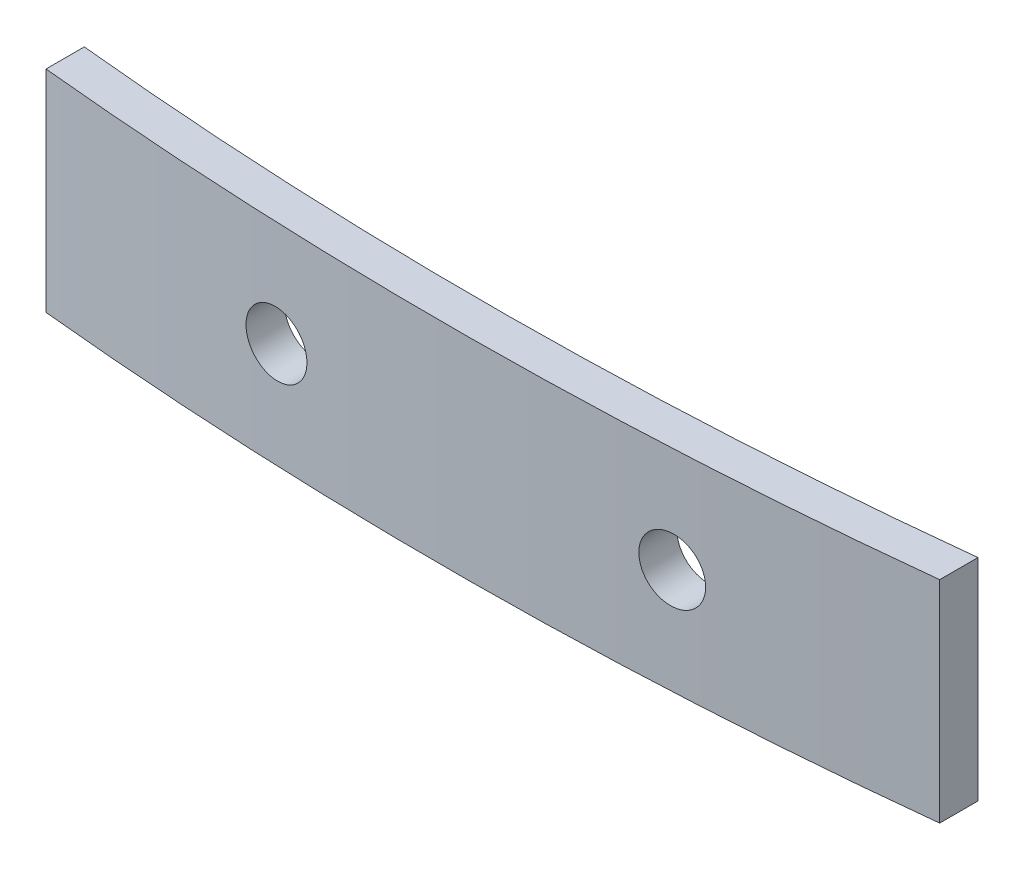
ISO-10303-21;
HEADER;
FILE_DESCRIPTION(('STEP AP214'),'2;1');
FILE_NAME('part.step','',(''),(''),'','','');
FILE_SCHEMA(('AUTOMOTIVE_DESIGN { 1 0 10303 214 1 1 1 1 }'));
ENDSEC;
DATA;
#1=APPLICATION_CONTEXT('core data for automotive mechanical design processes');
#2=APPLICATION_PROTOCOL_DEFINITION('international standard','automotive_design',2000,#1);
#3=PRODUCT_CONTEXT('',#1,'mechanical');
#4=PRODUCT('Part','Part','',(#3));
#5=PRODUCT_RELATED_PRODUCT_CATEGORY('part','',(#4));
#6=PRODUCT_DEFINITION_FORMATION('','',#4);
#7=PRODUCT_DEFINITION_CONTEXT('part definition',#1,'design');
#8=PRODUCT_DEFINITION('design','',#6,#7);
#9=PRODUCT_DEFINITION_SHAPE('','',#8);
#10=(LENGTH_UNIT() NAMED_UNIT(*) SI_UNIT(.MILLI.,.METRE.));
#11=(NAMED_UNIT(*) PLANE_ANGLE_UNIT() SI_UNIT($,.RADIAN.));
#12=(NAMED_UNIT(*) SI_UNIT($,.STERADIAN.) SOLID_ANGLE_UNIT());
#13=UNCERTAINTY_MEASURE_WITH_UNIT(LENGTH_MEASURE(1.E-05),#10,'distance_accuracy_value','');
#14=(GEOMETRIC_REPRESENTATION_CONTEXT(3) GLOBAL_UNCERTAINTY_ASSIGNED_CONTEXT((#13)) GLOBAL_UNIT_ASSIGNED_CONTEXT((#10,
#11,#12)) REPRESENTATION_CONTEXT('',''));
#15=CARTESIAN_POINT('',(0.,0.,0.));
#16=DIRECTION('',(0.,0.,1.));
#17=DIRECTION('',(1.,0.,0.));
#18=AXIS2_PLACEMENT_3D('',#15,#16,#17);
#19=CARTESIAN_POINT('',(-0.864955357188,8.3,-164.510629845193));
#20=DIRECTION('',(0.,-1.,0.));
#21=DIRECTION('',(0.,0.,-1.));
#22=AXIS2_PLACEMENT_3D('',#19,#20,#21);
#23=CYLINDRICAL_SURFACE('',#22,167.210703971618);
#24=CARTESIAN_POINT('',(-0.864955357188,0.,-164.510629845193));
#25=DIRECTION('',(0.,-1.,0.));
#26=DIRECTION('',(0.,0.,1.));
#27=AXIS2_PLACEMENT_3D('',#24,#25,#26);
#28=CIRCLE('',#27,167.210703971618);
#29=CARTESIAN_POINT('',(17.5,0.,1.68849150450751));
#30=VERTEX_POINT('',#29);
#31=CARTESIAN_POINT('',(-17.5,0.,1.87054340591625));
#32=VERTEX_POINT('',#31);
#33=EDGE_CURVE('E117',#30,#32,#28,.T.);
#34=ORIENTED_EDGE('',*,*,#33,.T.);
#35=DIRECTION('',(0.,-1.,0.));
#36=VECTOR('',#35,1.);
#37=CARTESIAN_POINT('',(-17.5,8.3,1.87054340591625));
#38=LINE('',#37,#36);
#39=CARTESIAN_POINT('',(-17.5,8.3,1.87054340591625));
#40=VERTEX_POINT('',#39);
#41=EDGE_CURVE('E11',#40,#32,#38,.T.);
#42=ORIENTED_EDGE('',*,*,#41,.F.);
#43=CARTESIAN_POINT('',(-0.864955357188,8.3,-164.510629845193));
#44=DIRECTION('',(0.,-1.,0.));
#45=DIRECTION('',(0.,0.,1.));
#46=AXIS2_PLACEMENT_3D('',#43,#44,#45);
#47=CIRCLE('',#46,167.210703971618);
#48=CARTESIAN_POINT('',(17.5,8.3,1.68849150450751));
#49=VERTEX_POINT('',#48);
#50=EDGE_CURVE('E99',#49,#40,#47,.T.);
#51=ORIENTED_EDGE('',*,*,#50,.F.);
#52=DIRECTION('',(0.,-1.,0.));
#53=VECTOR('',#52,1.);
#54=CARTESIAN_POINT('',(17.5,8.3,1.68849150450751));
#55=LINE('',#54,#53);
#56=EDGE_CURVE('E113',#49,#30,#55,.T.);
#57=ORIENTED_EDGE('',*,*,#56,.T.);
#58=EDGE_LOOP('',(#34,#42,#51,#57));
#59=FACE_BOUND('',#58,.T.);
#60=CARTESIAN_POINT('',(6.5,4.15,2.53779713115004));
#61=CARTESIAN_POINT('',(6.50000311830072,4.2201600528483,2.53779703356888));
#62=CARTESIAN_POINT('',(6.50592683250922,4.29037097447346,2.53753615101918));
#63=CARTESIAN_POINT('',(6.52947445822004,4.42885834488722,2.53649543364698));
#64=CARTESIAN_POINT('',(6.54711244591845,4.49713236319745,2.5357149744841));
#65=CARTESIAN_POINT('',(6.593583155423,4.6297187466707,2.53364651229168));
#66=CARTESIAN_POINT('',(6.62241033254543,4.69403305576497,2.53235876064082));
#67=CARTESIAN_POINT('',(6.69042977820944,4.81688874962342,2.52929601535595));
#68=CARTESIAN_POINT('',(6.72961948369922,4.87543155699319,2.52752114220171));
#69=CARTESIAN_POINT('',(6.81727240701778,4.98513523567161,2.52351282987057));
#70=CARTESIAN_POINT('',(6.86574015724651,5.03629247755706,2.52127916653188));
#71=CARTESIAN_POINT('',(6.97055942325953,5.12974635220956,2.51639484759461));
#72=CARTESIAN_POINT('',(7.02691128046353,5.17204260105485,2.51374417393686));
#73=CARTESIAN_POINT('',(7.14595131480201,5.24661412268197,2.50807702763504));
#74=CARTESIAN_POINT('',(7.2086452692116,5.27888014756526,2.50506022095671));
#75=CARTESIAN_POINT('',(7.33854573429652,5.33243009041771,2.49873012293615));
#76=CARTESIAN_POINT('',(7.40575226418267,5.35371396163058,2.4954168303317));
#77=CARTESIAN_POINT('',(7.5428494216453,5.38471994256582,2.4885709153848));
#78=CARTESIAN_POINT('',(7.61274294738313,5.39442918509865,2.48503805353334));
#79=CARTESIAN_POINT('',(7.7531616222027,5.40197190758309,2.47785036870086));
#80=CARTESIAN_POINT('',(7.82368677376782,5.39980534082174,2.47419554524016));
#81=CARTESIAN_POINT('',(7.96342985722233,5.38365274089719,2.46686575840938));
#82=CARTESIAN_POINT('',(8.0326466378837,5.36965675272819,2.46319078066725));
#83=CARTESIAN_POINT('',(8.16774794433558,5.33022812559369,2.45593678797151));
#84=CARTESIAN_POINT('',(8.23363245930642,5.30479544949665,2.45235777332949));
#85=CARTESIAN_POINT('',(8.36020377089505,5.24320862112569,2.44541222559091));
#86=CARTESIAN_POINT('',(8.42089009855844,5.20705350283695,2.4420457116723));
#87=CARTESIAN_POINT('',(8.53533088617573,5.12504404492505,2.43564124626815));
#88=CARTESIAN_POINT('',(8.58908537368798,5.07918974386402,2.4326032934764));
#89=CARTESIAN_POINT('',(8.68808413564137,4.97912437454379,2.42696754118702));
#90=CARTESIAN_POINT('',(8.73333590873341,4.92492074717713,2.42436935405706));
#91=CARTESIAN_POINT('',(8.81409389396076,4.80966323539121,2.41970643279685));
#92=CARTESIAN_POINT('',(8.8496001867816,4.74860940769255,2.41764169425003));
#93=CARTESIAN_POINT('',(8.90980168821073,4.62148553155661,2.41412733536457));
#94=CARTESIAN_POINT('',(8.93451353604402,4.55542338906069,2.41267676841059));
#95=CARTESIAN_POINT('',(8.97249675193018,4.4200775166296,2.41044259271686));
#96=CARTESIAN_POINT('',(8.98576822175059,4.3507938153575,2.40965897804425));
#97=CARTESIAN_POINT('',(9.00047882200267,4.21107570744998,2.4087901949542));
#98=CARTESIAN_POINT('',(9.00193452056621,4.14064305088972,2.40870404854379));
#99=CARTESIAN_POINT('',(8.9930154142881,4.00053370594098,2.40923102871897));
#100=CARTESIAN_POINT('',(8.98264065708287,3.93085701450969,2.40984415248887));
#101=CARTESIAN_POINT('',(8.9503655620009,3.79426844369779,2.41174509717095));
#102=CARTESIAN_POINT('',(8.92847026623645,3.72735536859114,2.4130326229213));
#103=CARTESIAN_POINT('',(8.8737837915955,3.59815694385367,2.4162320685688));
#104=CARTESIAN_POINT('',(8.84099258100937,3.53587160769127,2.41814399028308));
#105=CARTESIAN_POINT('',(8.76541982221783,3.41764155961199,2.42252092143321));
#106=CARTESIAN_POINT('',(8.72263037518888,3.36170191310341,2.42498636810516));
#107=CARTESIAN_POINT('',(8.62829367522125,3.2577981137888,2.43037761471364));
#108=CARTESIAN_POINT('',(8.57674634798289,3.20983402865227,2.43330341855572));
#109=CARTESIAN_POINT('',(8.46627103909551,3.12316384761996,2.43951479784418));
#110=CARTESIAN_POINT('',(8.40733179566604,3.08447214599152,2.4428009212656));
#111=CARTESIAN_POINT('',(8.28380750137,3.01753168134166,2.44961536945369));
#112=CARTESIAN_POINT('',(8.21922240939069,2.98928299437351,2.45314369598402));
#113=CARTESIAN_POINT('',(8.08614019581266,2.94399119053169,2.46033126551108));
#114=CARTESIAN_POINT('',(8.0176376688324,2.92696398359887,2.46399068666331));
#115=CARTESIAN_POINT('',(7.87874601955412,2.90466003783105,2.47132140491645));
#116=CARTESIAN_POINT('',(7.80835688551057,2.89938337216909,2.47499270209117));
#117=CARTESIAN_POINT('',(7.66764528599877,2.90073180929488,2.48224190393867));
#118=CARTESIAN_POINT('',(7.59732288570206,2.90736404166644,2.48581975136414));
#119=CARTESIAN_POINT('',(7.45878462599334,2.93235966108019,2.49278235889512));
#120=CARTESIAN_POINT('',(7.39056876893537,2.95072306123143,2.49616711878486));
#121=CARTESIAN_POINT('',(7.25820669782941,2.99865642610158,2.5026575116878));
#122=CARTESIAN_POINT('',(7.19405912200034,3.02822261753584,2.50576323824877));
#123=CARTESIAN_POINT('',(7.07163847251114,3.09772642357956,2.51162544242854));
#124=CARTESIAN_POINT('',(7.01336514139768,3.13766358338107,2.51438193535473));
#125=CARTESIAN_POINT('',(6.9044123768105,3.2267300456736,2.5194854771111));
#126=CARTESIAN_POINT('',(6.85372481706355,3.27584938297113,2.52183296453855));
#127=CARTESIAN_POINT('',(6.76130334568271,3.38193224768082,2.5260782387648));
#128=CARTESIAN_POINT('',(6.71957161192582,3.43889767758814,2.52797591619053));
#129=CARTESIAN_POINT('',(6.64629504219877,3.55899830925378,2.53128701689445));
#130=CARTESIAN_POINT('',(6.614743919168,3.62212967172133,2.53270073907335));
#131=CARTESIAN_POINT('',(6.56272376021015,3.75275215207936,2.53502196922212));
#132=CARTESIAN_POINT('',(6.54224136968559,3.82023790573416,2.5359300872515));
#133=CARTESIAN_POINT('',(6.51840966169869,3.93179630078508,2.53698468836411));
#134=CARTESIAN_POINT('',(6.51151470431355,3.97514204431732,2.53728912928755));
#135=CARTESIAN_POINT('',(6.50230890007655,4.06231856832874,2.53769538112666));
#136=CARTESIAN_POINT('',(6.49999805103457,4.10614934857616,2.53779719213913));
#137=CARTESIAN_POINT('',(6.5,4.15,2.53779713115004));
#138=B_SPLINE_CURVE_WITH_KNOTS('',3,(#60,#61,#62,#63,#64,#65,#66,#67,#68,#69,#70,#71,#72,#73,
#74,#75,#76,#77,#78,#79,#80,#81,#82,#83,#84,#85,#86,#87,#88,#89,#90,#91,#92,#93,#94,#95,#96,#97,
#98,#99,#100,#101,#102,#103,#104,#105,#106,#107,#108,#109,#110,#111,#112,#113,#114,#115,#116,
#117,#118,#119,#120,#121,#122,#123,#124,#125,#126,#127,#128,#129,#130,#131,#132,#133,#134,#135,
#136,#137),.UNSPECIFIED.,.T.,.F.,(4,2,2,2,2,2,2,2,2,2,2,2,2,2,2,2,2,2,2,2,2,2,2,2,2,2,2,2,2,2,2,
2,2,2,2,2,2,2,4),(0.,0.210320035472163,0.420893255693905,0.631362261542145,0.841779258925773,
1.05229931024653,1.2628284809202,1.47355118835342,1.68427479292679,1.89523243521323,
2.10619090729285,2.31732708766128,2.52846395353147,2.7396198470939,2.95077490115542,
3.1617428517856,3.37270905570111,3.58334890570873,3.79398688195663,4.00432944949815,
4.21467117007918,4.424920908374,4.63517125854935,4.84558827603943,5.05600707874424,
5.26675044568951,5.47749534738359,5.68853840640857,5.89958277963837,6.11075354241696,
6.32192454116966,6.53302447718547,6.74411515719746,6.95497806183269,7.16589218613083,
7.3766758095064,7.58720454814038,7.71865648688288,7.8501083628226),.UNSPECIFIED.);
#139=CARTESIAN_POINT('',(6.5,4.15,2.53779713115004));
#140=VERTEX_POINT('',#139);
#141=EDGE_CURVE('E138',#140,#140,#138,.T.);
#142=ORIENTED_EDGE('',*,*,#141,.F.);
#143=EDGE_LOOP('',(#142));
#144=FACE_BOUND('',#143,.T.);
#145=CARTESIAN_POINT('',(-9.,4.15,2.50206599360675));
#146=CARTESIAN_POINT('',(-8.9999968789846,4.22015392659101,2.50206618554172));
#147=CARTESIAN_POINT('',(-8.99407417658717,4.29035873068543,2.50235496193518));
#148=CARTESIAN_POINT('',(-8.97053082535261,4.42883359318577,2.50349920546083));
#149=CARTESIAN_POINT('',(-8.95289609973919,4.4971012202016,2.50435535452016));
#150=CARTESIAN_POINT('',(-8.90643478571085,4.62967430947023,2.50659881430219));
#151=CARTESIAN_POINT('',(-8.87761385256324,4.69398175481704,2.5079858566231));
#152=CARTESIAN_POINT('',(-8.80960947329652,4.81682546464163,2.51123443252684));
#153=CARTESIAN_POINT('',(-8.77042857227543,4.87536314171671,2.51309584956758));
#154=CARTESIAN_POINT('',(-8.68278601070888,4.9850703860922,2.51722102597792));
#155=CARTESIAN_POINT('',(-8.63431808054086,5.036234934716,2.51948505707536));
#156=CARTESIAN_POINT('',(-8.52949361157527,5.12970468199198,2.5243279425006));
#157=CARTESIAN_POINT('',(-8.47313672058647,5.17200948490304,2.52690681088319));
#158=CARTESIAN_POINT('',(-8.35407035350533,5.24660359631099,2.53228748153317));
#159=CARTESIAN_POINT('',(-8.29135420853412,5.27888224334472,2.53508951715917));
#160=CARTESIAN_POINT('',(-8.16139801259883,5.33245139876033,2.54081634269377));
#161=CARTESIAN_POINT('',(-8.09415794839092,5.35374187497259,2.54374113296173));
#162=CARTESIAN_POINT('',(-7.95700562805629,5.38474509749862,2.54961993904171));
#163=CARTESIAN_POINT('',(-7.88709133618139,5.39444883483721,2.55257397579667));
#164=CARTESIAN_POINT('',(-7.74662363106475,5.40197266553775,2.55841906921826));
#165=CARTESIAN_POINT('',(-7.67607021805432,5.39979276320068,2.56131012590768));
#166=CARTESIAN_POINT('',(-7.53631737546828,5.38360795028121,2.56694897423169));
#167=CARTESIAN_POINT('',(-7.46711812818554,5.36960145869888,2.56969674665963));
#168=CARTESIAN_POINT('',(-7.33204995513501,5.33015574247033,2.57497929333489));
#169=CARTESIAN_POINT('',(-7.26618102694138,5.30471652615198,2.57751406773735));
#170=CARTESIAN_POINT('',(-7.13967529197927,5.24313791888805,2.58231262134722));
#171=CARTESIAN_POINT('',(-7.07903622405426,5.20700318245829,2.58457651783571));
#172=CARTESIAN_POINT('',(-6.96468446660637,5.12505256805409,2.58878998227595));
#173=CARTESIAN_POINT('',(-6.9109717504013,5.0792367273757,2.59073955143857));
#174=CARTESIAN_POINT('',(-6.81203747553293,4.97925802415904,2.59428986539865));
#175=CARTESIAN_POINT('',(-6.76681012773489,4.9251008987258,2.59589084813945));
#176=CARTESIAN_POINT('',(-6.68608977992854,4.80995352949493,2.59872223701323));
#177=CARTESIAN_POINT('',(-6.65059674771484,4.7489633083051,2.59995264437223));
#178=CARTESIAN_POINT('',(-6.590376060798,4.62192237655231,2.6020267438483));
#179=CARTESIAN_POINT('',(-6.56564166867781,4.55587486360173,2.60287067800525));
#180=CARTESIAN_POINT('',(-6.52761073193537,4.42056138087808,2.60416370089424));
#181=CARTESIAN_POINT('',(-6.51431415871405,4.35129541915288,2.60461279061355));
#182=CARTESIAN_POINT('',(-6.49954079239336,4.21154064500586,2.60511156027287));
#183=CARTESIAN_POINT('',(-6.49805932903814,4.14105232679781,2.60516139802852));
#184=CARTESIAN_POINT('',(-6.50694607500547,4.00082757280868,2.60486160439767));
#185=CARTESIAN_POINT('',(-6.51731427167745,3.93109113622496,2.60451197343762));
#186=CARTESIAN_POINT('',(-6.54960324564899,3.7943571841506,2.60341671966623));
#187=CARTESIAN_POINT('',(-6.5715228123632,3.72735938244327,2.60267113835048));
#188=CARTESIAN_POINT('',(-6.62628963110505,3.59799583377631,2.60079195620987));
#189=CARTESIAN_POINT('',(-6.65913688578675,3.53563008794169,2.59965835529077));
#190=CARTESIAN_POINT('',(-6.73483166859743,3.41728730499127,2.59701660989913));
#191=CARTESIAN_POINT('',(-6.77768113562152,3.36131150968244,2.59550839280487));
#192=CARTESIAN_POINT('',(-6.87215792978473,3.25734839500569,2.59213873834546));
#193=CARTESIAN_POINT('',(-6.92378527798313,3.20936109480376,2.59027730013288));
#194=CARTESIAN_POINT('',(-7.0343770124007,3.12271195576185,2.58623073710219));
#195=CARTESIAN_POINT('',(-7.09334487425577,3.08405456016075,2.58404545885613));
#196=CARTESIAN_POINT('',(-7.21692291467281,3.01718732082311,2.57939334339435));
#197=CARTESIAN_POINT('',(-7.28153310692913,2.98897750244451,2.57692650549527));
#198=CARTESIAN_POINT('',(-7.41460725247868,2.94378577926695,2.57176305079366));
#199=CARTESIAN_POINT('',(-7.48307375578416,2.92681140084984,2.56906628132723));
#200=CARTESIAN_POINT('',(-7.62187848301808,2.90459846176945,2.56351038955912));
#201=CARTESIAN_POINT('',(-7.69221671793101,2.89935996999512,2.56065126630453));
#202=CARTESIAN_POINT('',(-7.83281637138237,2.90076536385271,2.55484650857032));
#203=CARTESIAN_POINT('',(-7.90307771107605,2.90741691833229,2.55190081946276));
#204=CARTESIAN_POINT('',(-8.04148512738746,2.93242782586422,2.54601247447333));
#205=CARTESIAN_POINT('',(-8.10963119421408,2.95078723310107,2.54306981860556));
#206=CARTESIAN_POINT('',(-8.241895354265,2.99870164424562,2.53728144363261));
#207=CARTESIAN_POINT('',(-8.30601218718679,3.02826013098761,2.53443575498392));
#208=CARTESIAN_POINT('',(-8.42837082553149,3.09773467630274,2.52894039080036));
#209=CARTESIAN_POINT('',(-8.48661286568478,3.13765032082243,2.52629070743512));
#210=CARTESIAN_POINT('',(-8.5955437277431,3.22668945212403,2.52128478020098));
#211=CARTESIAN_POINT('',(-8.64623586141244,3.27580888019099,2.51892840774627));
#212=CARTESIAN_POINT('',(-8.73866512901045,3.38189143455903,2.51459688510446));
#213=CARTESIAN_POINT('',(-8.78040007437305,3.43885647225799,2.51262182809836));
#214=CARTESIAN_POINT('',(-8.85368941957521,3.55896764454512,2.50913246037367));
#215=CARTESIAN_POINT('',(-8.88524832561627,3.62211102701864,2.5076179457325));
#216=CARTESIAN_POINT('',(-8.93727980646051,3.75276028135037,2.50511128627954));
#217=CARTESIAN_POINT('',(-8.95776576458918,3.82026077596767,2.50411851090768));
#218=CARTESIAN_POINT('',(-8.98159577176555,3.931828323578,2.50296166374095));
#219=CARTESIAN_POINT('',(-8.9884886838119,3.97516767163756,2.50262636687851));
#220=CARTESIAN_POINT('',(-8.9976917716211,4.06233138927276,2.50217847191128));
#221=CARTESIAN_POINT('',(-9.00000195054731,4.10615575851357,2.50206587365277));
#222=CARTESIAN_POINT('',(-9.,4.15,2.50206599360675));
#223=B_SPLINE_CURVE_WITH_KNOTS('',3,(#145,#146,#147,#148,#149,#150,#151,#152,#153,#154,#155,
#156,#157,#158,#159,#160,#161,#162,#163,#164,#165,#166,#167,#168,#169,#170,#171,#172,#173,#174,
#175,#176,#177,#178,#179,#180,#181,#182,#183,#184,#185,#186,#187,#188,#189,#190,#191,#192,#193,
#194,#195,#196,#197,#198,#199,#200,#201,#202,#203,#204,#205,#206,#207,#208,#209,#210,#211,#212,
#213,#214,#215,#216,#217,#218,#219,#220,#221,#222),.UNSPECIFIED.,.T.,.F.,(4,2,2,2,2,2,2,2,2,2,2,
2,2,2,2,2,2,2,2,2,2,2,2,2,2,2,2,2,2,2,2,2,2,2,2,2,2,2,4),(0.,0.210301643941587,
0.420856509681721,0.631305066265064,0.841701970625624,1.05224141643252,1.26279026446753,
1.47356224230451,1.68433483720616,1.89527120650513,2.10620749946128,2.3171719952294,
2.52813633732614,2.73900900582891,2.94988086196861,3.16060832361605,3.37133508807649,
3.58192969779077,3.79252378093362,4.00303461668978,4.21354522770696,4.42403378156556,
4.6345223865464,4.84505182796709,5.05558177448261,5.26621178602277,5.47684230879222,
5.68761378604787,5.89838650051611,6.10929520832399,6.32020489223412,6.53118022147071,
6.74214711773653,6.95302119914314,7.16394674622767,7.37477876158737,7.58535538162698,
7.71678811639713,7.84822076044173),.UNSPECIFIED.);
#224=CARTESIAN_POINT('',(-9.,4.15,2.50206599360675));
#225=VERTEX_POINT('',#224);
#226=EDGE_CURVE('E121',#225,#225,#223,.T.);
#227=ORIENTED_EDGE('',*,*,#226,.F.);
#228=EDGE_LOOP('',(#227));
#229=FACE_BOUND('',#228,.T.);
#230=ADVANCED_FACE('F39',(#59,#144,#229),#23,.F.);
#231=CARTESIAN_POINT('',(-0.864955357188,8.3,-164.510629845193));
#232=DIRECTION('',(0.,-1.,0.));
#233=DIRECTION('',(0.,0.,-1.));
#234=AXIS2_PLACEMENT_3D('',#231,#232,#233);
#235=CYLINDRICAL_SURFACE('',#234,168.710703971618);
#236=CARTESIAN_POINT('',(-0.864955357188,0.,-164.510629845193));
#237=DIRECTION('',(0.,1.,0.));
#238=DIRECTION('',(0.,0.,1.));
#239=AXIS2_PLACEMENT_3D('',#236,#237,#238);
#240=CIRCLE('',#239,168.710703971618);
#241=CARTESIAN_POINT('',(-17.5,0.,3.37795500896115));
#242=VERTEX_POINT('',#241);
#243=CARTESIAN_POINT('',(17.5,0.,3.19753945292844));
#244=VERTEX_POINT('',#243);
#245=EDGE_CURVE('E81',#242,#244,#240,.T.);
#246=ORIENTED_EDGE('',*,*,#245,.T.);
#247=DIRECTION('',(0.,-1.,0.));
#248=VECTOR('',#247,1.);
#249=CARTESIAN_POINT('',(17.5,8.3,3.19753945292844));
#250=LINE('',#249,#248);
#251=CARTESIAN_POINT('',(17.5,8.3,3.19753945292844));
#252=VERTEX_POINT('',#251);
#253=EDGE_CURVE('E106',#252,#244,#250,.T.);
#254=ORIENTED_EDGE('',*,*,#253,.F.);
#255=CARTESIAN_POINT('',(-0.864955357188,8.3,-164.510629845193));
#256=DIRECTION('',(0.,1.,0.));
#257=DIRECTION('',(0.,0.,1.));
#258=AXIS2_PLACEMENT_3D('',#255,#256,#257);
#259=CIRCLE('',#258,168.710703971618);
#260=CARTESIAN_POINT('',(-17.5,8.3,3.37795500896115));
#261=VERTEX_POINT('',#260);
#262=EDGE_CURVE('E97',#261,#252,#259,.T.);
#263=ORIENTED_EDGE('',*,*,#262,.F.);
#264=DIRECTION('',(0.,-1.,0.));
#265=VECTOR('',#264,1.);
#266=CARTESIAN_POINT('',(-17.5,8.3,3.37795500896115));
#267=LINE('',#266,#265);
#268=EDGE_CURVE('E55',#261,#242,#267,.T.);
#269=ORIENTED_EDGE('',*,*,#268,.T.);
#270=EDGE_LOOP('',(#246,#254,#263,#269));
#271=FACE_BOUND('',#270,.T.);
#272=CARTESIAN_POINT('',(6.5,4.15,4.03924131223476));
#273=CARTESIAN_POINT('',(6.50000311821644,4.07983900859695,4.03924121552748));
#274=CARTESIAN_POINT('',(6.50592698943899,4.00962714769121,4.03898265006684));
#275=CARTESIAN_POINT('',(6.52947525777152,3.87113790994845,4.03795117528823));
#276=CARTESIAN_POINT('',(6.54711373158644,3.80286296362511,4.0371776471692));
#277=CARTESIAN_POINT('',(6.5935857873165,3.67027474837752,4.03512755161367));
#278=CARTESIAN_POINT('',(6.62241382786342,3.60595953672604,4.03385123316753));
#279=CARTESIAN_POINT('',(6.69043542031096,3.48310215407869,4.03081567544885));
#280=CARTESIAN_POINT('',(6.72962640880317,3.42455856030873,4.02905655559936));
#281=CARTESIAN_POINT('',(6.8172820530594,3.31485390784877,4.02508382682747));
#282=CARTESIAN_POINT('',(6.86575117837123,3.26369642818558,4.02286999882129));
#283=CARTESIAN_POINT('',(6.97057354743463,3.17024232360844,4.01802904805097));
#284=CARTESIAN_POINT('',(7.02692713205723,3.12794608199243,4.01540190741736));
#285=CARTESIAN_POINT('',(7.14596995548139,3.0533755885601,4.00978511600482));
#286=CARTESIAN_POINT('',(7.20866486743313,3.02111041785869,4.00679514013587));
#287=CARTESIAN_POINT('',(7.33856734711277,2.96756235584867,4.0005213413924));
#288=CARTESIAN_POINT('',(7.40577493355283,2.9462795100823,3.99723751729939));
#289=CARTESIAN_POINT('',(7.54287287382637,2.91527615684631,3.9904525607616));
#290=CARTESIAN_POINT('',(7.61276607455011,2.90556828916056,3.98695119514316));
#291=CARTESIAN_POINT('',(7.75318398462447,2.8980281750774,3.97982760071573));
#292=CARTESIAN_POINT('',(7.82370869639393,2.90019597418601,3.97620537144366));
#293=CARTESIAN_POINT('',(7.96344967877755,2.91635077058775,3.96894102179307));
#294=CARTESIAN_POINT('',(8.03266481846192,2.93034754597473,3.96529888743595));
#295=CARTESIAN_POINT('',(8.16776273741988,2.96977719915022,3.95810974015306));
#296=CARTESIAN_POINT('',(8.23364550600481,2.99521011361783,3.95456272753242));
#297=CARTESIAN_POINT('',(8.36021317750195,3.05679674125216,3.94767930532073));
#298=CARTESIAN_POINT('',(8.42089762011192,3.09295140254778,3.94434291438671));
#299=CARTESIAN_POINT('',(8.53533475109379,3.17495920939541,3.93799576571538));
#300=CARTESIAN_POINT('',(8.58908746658606,3.22081231700043,3.93498500670404));
#301=CARTESIAN_POINT('',(8.68808377782325,3.32087531831846,3.92939965986203));
#302=CARTESIAN_POINT('',(8.73333473937803,3.37507790335134,3.92682469465891));
#303=CARTESIAN_POINT('',(8.81409134650165,3.49033280947923,3.92220344736401));
#304=CARTESIAN_POINT('',(8.84959707129266,3.5513850748853,3.92015716097442));
#305=CARTESIAN_POINT('',(8.9097987203869,3.67850714182677,3.91667414586709));
#306=CARTESIAN_POINT('',(8.93451098835277,3.74456917818108,3.91523649564267));
#307=CARTESIAN_POINT('',(8.97249503617838,3.87991472439955,3.9130222036996));
#308=CARTESIAN_POINT('',(8.98576691600336,3.9491982061094,3.91224555620515));
#309=CARTESIAN_POINT('',(9.00047858396002,4.08891761505717,3.91138446160091));
#310=CARTESIAN_POINT('',(9.00193464639936,4.15935182324617,3.91129906241287));
#311=CARTESIAN_POINT('',(8.9930157402488,4.29946432254685,3.91182132938171));
#312=CARTESIAN_POINT('',(8.98264081844691,4.36914261664686,3.91242899279773));
#313=CARTESIAN_POINT('',(8.95036468700418,4.50573494537357,3.91431303885405));
#314=CARTESIAN_POINT('',(8.92846843044031,4.5726501545421,3.91558913413124));
#315=CARTESIAN_POINT('',(8.87377921065577,4.70185269258961,3.91876019569581));
#316=CARTESIAN_POINT('',(8.8409862163099,4.76414000824897,3.92065516375093));
#317=CARTESIAN_POINT('',(8.76540956464805,4.88237282754171,3.92499327057981));
#318=CARTESIAN_POINT('',(8.72261814798466,4.93831335535867,3.92743683503779));
#319=CARTESIAN_POINT('',(8.62827692294248,5.04221853556737,3.93278024197428));
#320=CARTESIAN_POINT('',(8.57672704150597,5.09018312142211,3.93568008825879));
#321=CARTESIAN_POINT('',(8.46624763257672,5.17685250771872,3.94183628410163));
#322=CARTESIAN_POINT('',(8.40730704222217,5.21554316817252,3.94509316715556));
#323=CARTESIAN_POINT('',(8.28378001097383,5.28248131570165,3.95184697684577));
#324=CARTESIAN_POINT('',(8.21919352979874,5.31072872826082,3.95534390519465));
#325=CARTESIAN_POINT('',(8.08611029795493,5.35601708706464,3.96246741698823));
#326=CARTESIAN_POINT('',(8.01760823799984,5.37304240537618,3.9660941738585));
#327=CARTESIAN_POINT('',(7.87871783527179,5.39534282461644,3.97335944682003));
#328=CARTESIAN_POINT('',(7.80832948090368,5.4006178532987,3.97699796298346));
#329=CARTESIAN_POINT('',(7.66762053519389,5.39926646401132,3.98418238604978));
#330=CARTESIAN_POINT('',(7.59730000806059,5.39263304400314,3.98772823722281));
#331=CARTESIAN_POINT('',(7.45876575456234,5.36763572035665,3.99462856946874));
#332=CARTESIAN_POINT('',(7.39055203058462,5.34927180342702,3.9979830503248));
#333=CARTESIAN_POINT('',(7.25819393508083,5.30133802586427,4.00441539585197));
#334=CARTESIAN_POINT('',(7.19404822705777,5.2717718680891,4.00749335151198));
#335=CARTESIAN_POINT('',(7.07163132096953,5.20226884492976,4.0133031329288));
#336=CARTESIAN_POINT('',(7.01335986592901,5.16233243347673,4.01603497382811));
#337=CARTESIAN_POINT('',(6.90440970126537,5.0732674380006,4.02109291899384));
#338=CARTESIAN_POINT('',(6.85372299555039,5.02414865901682,4.02341945098137));
#339=CARTESIAN_POINT('',(6.76130311542266,4.9180673552612,4.02762682906566));
#340=CARTESIAN_POINT('',(6.71957211975892,4.86110292731781,4.02950756672099));
#341=CARTESIAN_POINT('',(6.64629602031458,4.74100352127971,4.03278914867204));
#342=CARTESIAN_POINT('',(6.61474482710605,4.67787226166189,4.03419027989289));
#343=CARTESIAN_POINT('',(6.5627245280606,4.54725012163237,4.03649083798607));
#344=CARTESIAN_POINT('',(6.54224206886014,4.47976460478743,4.03739086942698));
#345=CARTESIAN_POINT('',(6.51841005492601,4.36820601693854,4.03843608951054));
#346=CARTESIAN_POINT('',(6.5115149493841,4.32485980916441,4.03873782494768));
#347=CARTESIAN_POINT('',(6.50230894854312,4.23768235789113,4.03914046648403));
#348=CARTESIAN_POINT('',(6.49999805109272,4.19385111461962,4.0392413726775));
#349=CARTESIAN_POINT('',(6.5,4.15,4.03924131223476));
#350=B_SPLINE_CURVE_WITH_KNOTS('',3,(#272,#273,#274,#275,#276,#277,#278,#279,#280,#281,#282,
#283,#284,#285,#286,#287,#288,#289,#290,#291,#292,#293,#294,#295,#296,#297,#298,#299,#300,#301,
#302,#303,#304,#305,#306,#307,#308,#309,#310,#311,#312,#313,#314,#315,#316,#317,#318,#319,#320,
#321,#322,#323,#324,#325,#326,#327,#328,#329,#330,#331,#332,#333,#334,#335,#336,#337,#338,#339,
#340,#341,#342,#343,#344,#345,#346,#347,#348,#349),.UNSPECIFIED.,.T.,.F.,(4,2,2,2,2,2,2,2,2,2,2,
2,2,2,2,2,2,2,2,2,2,2,2,2,2,2,2,2,2,2,2,2,2,2,2,2,2,2,4),(0.,0.21032285065951,0.420898891500716,
0.631370782317331,0.841790658830802,1.0523121569659,1.26284275944984,1.47356340371594,
1.68428492180584,1.89523633598719,2.10618855850775,2.31731532956252,2.52844277776863,
2.73958890164003,2.95073419937743,3.16169571135771,3.372655508313,3.58329474891462,
3.79393214894812,4.0042793819482,4.21462578309076,4.42488182910304,4.63513847569105,
4.84555883861547,5.05598095682341,5.26672189415471,5.47746433516598,5.68849964034594,
5.89953624306924,6.11069697366875,6.32185794352577,6.53294917573723,6.74403116953091,
6.95488904180111,7.16579815365963,7.37658086745767,7.58710872125056,7.71856204845135,
7.85001531396198),.UNSPECIFIED.);
#351=CARTESIAN_POINT('',(6.5,4.15,4.03924131223476));
#352=VERTEX_POINT('',#351);
#353=EDGE_CURVE('E131',#352,#352,#350,.T.);
#354=ORIENTED_EDGE('',*,*,#353,.F.);
#355=EDGE_LOOP('',(#354));
#356=FACE_BOUND('',#355,.T.);
#357=CARTESIAN_POINT('',(-9.,4.15,4.00382853526265));
#358=CARTESIAN_POINT('',(-8.99999687911659,4.07984502633881,4.00382872548164));
#359=CARTESIAN_POINT('',(-8.99407400179579,4.00963917459052,4.00411493681468));
#360=CARTESIAN_POINT('',(-8.97052993227765,3.87116222315919,4.00524901773181));
#361=CARTESIAN_POINT('',(-8.95289466280278,3.80289355488584,4.00609756318999));
#362=CARTESIAN_POINT('',(-8.90643183624862,3.67031839828944,4.00832110235648));
#363=CARTESIAN_POINT('',(-8.87760992916895,3.60600992876898,4.00969583030262));
#364=CARTESIAN_POINT('',(-8.80960313648298,3.48316431773872,4.01291557040369));
#365=CARTESIAN_POINT('',(-8.77042079664787,3.42462576328645,4.0147604670245));
#366=CARTESIAN_POINT('',(-8.68277533044708,3.31491760773199,4.01884901705911));
#367=CARTESIAN_POINT('',(-8.63430602799477,3.26375295037439,4.02109293576179));
#368=CARTESIAN_POINT('',(-8.52947854701956,3.17028325362986,4.02589280206471));
#369=CARTESIAN_POINT('',(-8.47312001704397,3.12797860915227,4.02844876356532));
#370=CARTESIAN_POINT('',(-8.35405132597718,3.05338592633764,4.03378158953748));
#371=CARTESIAN_POINT('',(-8.29133461612006,3.02110835755454,4.03655868112286));
#372=CARTESIAN_POINT('',(-8.16137739190089,2.96754142454835,4.04223452149233));
#373=CARTESIAN_POINT('',(-8.09413686469101,2.94625209153383,4.04513327062193));
#374=CARTESIAN_POINT('',(-7.95698473984485,2.91525144961586,4.05095968793791));
#375=CARTESIAN_POINT('',(-7.88707114263138,2.90554899028414,4.0538873765086));
#376=CARTESIAN_POINT('',(-7.74660507509065,2.89802743411505,4.05968032894632));
#377=CARTESIAN_POINT('',(-7.67605260501102,2.90020833267169,4.06254559283755));
#378=CARTESIAN_POINT('',(-7.53630204073127,2.91639476988055,4.06813412100627));
#379=CARTESIAN_POINT('',(-7.46710412560258,2.9304018612907,4.07085736658715));
#380=CARTESIAN_POINT('',(-7.33203875687078,2.96984829741077,4.07609275666334));
#381=CARTESIAN_POINT('',(-7.26617130094693,2.99528763415434,4.07860490130573));
#382=CARTESIAN_POINT('',(-7.13966804400318,3.05686618297633,4.08336063124952));
#383=CARTESIAN_POINT('',(-7.07903002178616,3.0930008230405,4.08560433073118));
#384=CARTESIAN_POINT('',(-6.96468033953217,3.17495082904334,4.08978020395954));
#385=CARTESIAN_POINT('',(-6.910968653237,3.22076615828014,4.09171237888727));
#386=CARTESIAN_POINT('',(-6.81203568189268,3.32074403246828,4.09523103941781));
#387=CARTESIAN_POINT('',(-6.7668087103755,3.3749009422332,4.09681775666216));
#388=CARTESIAN_POINT('',(-6.68608906974859,3.49004766447824,4.099623916117));
#389=CARTESIAN_POINT('',(-6.65059636902787,3.55103745476841,4.10084335952017));
#390=CARTESIAN_POINT('',(-6.59037587397156,3.67807805335364,4.10289899008837));
#391=CARTESIAN_POINT('',(-6.56564146166092,3.7441257207938,4.1037354128858));
#392=CARTESIAN_POINT('',(-6.52761053999915,3.87943945419578,4.10501692589383));
#393=CARTESIAN_POINT('',(-6.51431400254687,3.94870551225006,4.10546201706586));
#394=CARTESIAN_POINT('',(-6.49954068272828,4.08846093813965,4.10595634563385));
#395=CARTESIAN_POINT('',(-6.4980593128397,4.15894982052913,4.10600573666991));
#396=CARTESIAN_POINT('',(-6.50694643352966,4.2991756813677,4.10570859894667));
#397=CARTESIAN_POINT('',(-6.51731491169092,4.36891266060462,4.10536207060224));
#398=CARTESIAN_POINT('',(-6.54960467747415,4.50564779266525,4.10427653892875));
#399=CARTESIAN_POINT('',(-6.57152477595895,4.57264622663315,4.10353757599731));
#400=CARTESIAN_POINT('',(-6.62629291903029,4.70201096155937,4.10167507510694));
#401=CARTESIAN_POINT('',(-6.65914096619861,4.76437726142334,4.10055153705716));
#402=CARTESIAN_POINT('',(-6.73483748338904,4.88272081569556,4.09793324529946));
#403=CARTESIAN_POINT('',(-6.77768785801902,4.93869685026548,4.09643842088903));
#404=CARTESIAN_POINT('',(-6.87216669824594,5.04266029116125,4.09309868681946));
#405=CARTESIAN_POINT('',(-6.92379518459326,5.09064767860237,4.09125377633278));
#406=CARTESIAN_POINT('',(-7.03438895685658,5.17729639056959,4.0872431574274));
#407=CARTESIAN_POINT('',(-7.09335765702355,5.21595335035499,4.08507729963235));
#408=CARTESIAN_POINT('',(-7.21693747812557,5.28281956528464,4.08046652729414));
#409=CARTESIAN_POINT('',(-7.28154861240822,5.31102879571317,4.07802161209083));
#410=CARTESIAN_POINT('',(-7.41462391435739,5.35621884561702,4.07290407615886));
#411=CARTESIAN_POINT('',(-7.48309058688707,5.37319227193467,4.07023130680498));
#412=CARTESIAN_POINT('',(-7.62189560354946,5.39540329847674,4.06472486484135));
#413=CARTESIAN_POINT('',(-7.6922339585318,5.40064083065635,4.06189119129877));
#414=CARTESIAN_POINT('',(-7.83283294164632,5.39923349667971,4.05613814320306));
#415=CARTESIAN_POINT('',(-7.90309349226969,5.39258109803718,4.05321871547562));
#416=CARTESIAN_POINT('',(-8.0414992258176,5.36756875817565,4.04738287567715));
#417=CARTESIAN_POINT('',(-8.10964439904904,5.34920876331834,4.04446646362));
#418=CARTESIAN_POINT('',(-8.24190632413181,5.30129360135098,4.03872973741515));
#419=CARTESIAN_POINT('',(-8.30602183675092,5.27173500981302,4.0359094529502));
#420=CARTESIAN_POINT('',(-8.42837783584382,5.20226072346568,4.03046315648649));
#421=CARTESIAN_POINT('',(-8.48661855697557,5.16234544256329,4.02783713672929));
#422=CARTESIAN_POINT('',(-8.59554720868316,5.07330728731344,4.02287590753866));
#423=CARTESIAN_POINT('',(-8.6462384064779,5.02418841692206,4.0205405723775));
#424=CARTESIAN_POINT('',(-8.73866594265723,4.91810741345729,4.01624772407035));
#425=CARTESIAN_POINT('',(-8.78040009179382,4.86114336846859,4.01429030330448));
#426=CARTESIAN_POINT('',(-8.8536887365792,4.74103360551672,4.0108320621181));
#427=CARTESIAN_POINT('',(-8.88524757256399,4.67789053827158,4.00933104703082));
#428=CARTESIAN_POINT('',(-8.93727898823586,4.54724209802388,4.00684672857181));
#429=CARTESIAN_POINT('',(-8.95776494950587,4.47974210136188,4.00586280034001));
#430=CARTESIAN_POINT('',(-8.98159528779054,4.36817452940942,4.00471624674527));
#431=CARTESIAN_POINT('',(-8.98848838216598,4.3248346100846,4.00438392917411));
#432=CARTESIAN_POINT('',(-8.99769171194752,4.23766975108637,4.00394001406698));
#433=CARTESIAN_POINT('',(-9.00000195046108,4.19384481174185,4.00382841638134));
#434=CARTESIAN_POINT('',(-9.,4.15,4.00382853526265));
#435=B_SPLINE_CURVE_WITH_KNOTS('',3,(#357,#358,#359,#360,#361,#362,#363,#364,#365,#366,#367,
#368,#369,#370,#371,#372,#373,#374,#375,#376,#377,#378,#379,#380,#381,#382,#383,#384,#385,#386,
#387,#388,#389,#390,#391,#392,#393,#394,#395,#396,#397,#398,#399,#400,#401,#402,#403,#404,#405,
#406,#407,#408,#409,#410,#411,#412,#413,#414,#415,#416,#417,#418,#419,#420,#421,#422,#423,#424,
#425,#426,#427,#428,#429,#430,#431,#432,#433,#434),.UNSPECIFIED.,.T.,.F.,(4,2,2,2,2,2,2,2,2,2,2,
2,2,2,2,2,2,2,2,2,2,2,2,2,2,2,2,2,2,2,2,2,2,2,2,2,2,2,4),(0.,0.210304784924287,
0.420862796470645,0.631314600245847,0.841714739667695,1.05225528970966,1.26280522198902,
1.47357426219802,1.6843439010257,1.89527441418617,2.10620484558988,2.31716297608868,
2.52812095958496,2.73898889296234,2.94985602690159,3.16058132853005,3.37130594584302,
3.58190075166872,3.79249504009312,4.00300755625049,4.21351985181548,4.4240104812328,
4.63450116037917,4.84503195316072,5.0555632436183,5.26619282980732,5.47682291427,
5.68759145590011,5.89836121956493,6.10926455702065,6.32016886073649,6.53113770917181,
6.74209812749672,6.95296698118833,7.16388731610166,7.37471756238857,7.58529244713096,
7.71672689111227,7.8481612459728),.UNSPECIFIED.);
#436=CARTESIAN_POINT('',(-9.,4.15,4.00382853526265));
#437=VERTEX_POINT('',#436);
#438=EDGE_CURVE('E43',#437,#437,#435,.T.);
#439=ORIENTED_EDGE('',*,*,#438,.F.);
#440=EDGE_LOOP('',(#439));
#441=FACE_BOUND('',#440,.T.);
#442=ADVANCED_FACE('F108',(#271,#356,#441),#235,.T.);
#443=CARTESIAN_POINT('',(-17.5,8.3,1.87054340591625));
#444=DIRECTION('',(1.,0.,0.));
#445=DIRECTION('',(0.,0.,-1.));
#446=AXIS2_PLACEMENT_3D('',#443,#444,#445);
#447=PLANE('',#446);
#448=DIRECTION('',(0.,0.,1.));
#449=VECTOR('',#448,1.);
#450=CARTESIAN_POINT('',(-17.5,0.,1.87054340591625));
#451=LINE('',#450,#449);
#452=EDGE_CURVE('E104',#32,#242,#451,.T.);
#453=ORIENTED_EDGE('',*,*,#452,.T.);
#454=ORIENTED_EDGE('',*,*,#268,.F.);
#455=DIRECTION('',(0.,0.,1.));
#456=VECTOR('',#455,1.);
#457=CARTESIAN_POINT('',(-17.5,8.3,1.87054340591625));
#458=LINE('',#457,#456);
#459=EDGE_CURVE('E94',#40,#261,#458,.T.);
#460=ORIENTED_EDGE('',*,*,#459,.F.);
#461=ORIENTED_EDGE('',*,*,#41,.T.);
#462=EDGE_LOOP('',(#453,#454,#460,#461));
#463=FACE_BOUND('',#462,.T.);
#464=ADVANCED_FACE('F103',(#463),#447,.F.);
#465=CARTESIAN_POINT('',(17.5,8.3,1.68849150450751));
#466=DIRECTION('',(-1.,0.,0.));
#467=DIRECTION('',(0.,0.,1.));
#468=AXIS2_PLACEMENT_3D('',#465,#466,#467);
#469=PLANE('',#468);
#470=DIRECTION('',(0.,0.,-1.));
#471=VECTOR('',#470,1.);
#472=CARTESIAN_POINT('',(17.5,0.,1.68849150450751));
#473=LINE('',#472,#471);
#474=EDGE_CURVE('E87',#244,#30,#473,.T.);
#475=ORIENTED_EDGE('',*,*,#474,.T.);
#476=ORIENTED_EDGE('',*,*,#56,.F.);
#477=DIRECTION('',(0.,0.,-1.));
#478=VECTOR('',#477,1.);
#479=CARTESIAN_POINT('',(17.5,8.3,1.68849150450751));
#480=LINE('',#479,#478);
#481=EDGE_CURVE('E64',#252,#49,#480,.T.);
#482=ORIENTED_EDGE('',*,*,#481,.F.);
#483=ORIENTED_EDGE('',*,*,#253,.T.);
#484=EDGE_LOOP('',(#475,#476,#482,#483));
#485=FACE_BOUND('',#484,.T.);
#486=ADVANCED_FACE('F175',(#485),#469,.F.);
#487=CARTESIAN_POINT('',(-0.864955357188,8.3,-164.510629845193));
#488=DIRECTION('',(0.,1.,0.));
#489=DIRECTION('',(0.,0.,1.));
#490=AXIS2_PLACEMENT_3D('',#487,#488,#489);
#491=PLANE('',#490);
#492=ORIENTED_EDGE('',*,*,#50,.T.);
#493=ORIENTED_EDGE('',*,*,#459,.T.);
#494=ORIENTED_EDGE('',*,*,#262,.T.);
#495=ORIENTED_EDGE('',*,*,#481,.T.);
#496=EDGE_LOOP('',(#492,#493,#494,#495));
#497=FACE_BOUND('',#496,.T.);
#498=ADVANCED_FACE('F95',(#497),#491,.T.);
#499=CARTESIAN_POINT('',(-0.864955357188,0.,-164.510629845193));
#500=DIRECTION('',(0.,1.,0.));
#501=DIRECTION('',(0.,0.,1.));
#502=AXIS2_PLACEMENT_3D('',#499,#500,#501);
#503=PLANE('',#502);
#504=ORIENTED_EDGE('',*,*,#33,.F.);
#505=ORIENTED_EDGE('',*,*,#474,.F.);
#506=ORIENTED_EDGE('',*,*,#245,.F.);
#507=ORIENTED_EDGE('',*,*,#452,.F.);
#508=EDGE_LOOP('',(#504,#505,#506,#507));
#509=FACE_BOUND('',#508,.T.);
#510=ADVANCED_FACE('F146',(#509),#503,.F.);
#511=CARTESIAN_POINT('',(7.75,4.15,1.68849150450751));
#512=DIRECTION('',(0.,0.,-1.));
#513=DIRECTION('',(-1.,0.,0.));
#514=AXIS2_PLACEMENT_3D('',#511,#512,#513);
#515=CYLINDRICAL_SURFACE('',#514,1.25);
#516=ORIENTED_EDGE('',*,*,#353,.T.);
#517=EDGE_LOOP('',(#516));
#518=FACE_BOUND('',#517,.T.);
#519=ORIENTED_EDGE('',*,*,#141,.T.);
#520=EDGE_LOOP('',(#519));
#521=FACE_BOUND('',#520,.T.);
#522=ADVANCED_FACE('F141',(#518,#521),#515,.F.);
#523=CARTESIAN_POINT('',(-7.75,4.15,1.68849150450751));
#524=DIRECTION('',(0.,0.,-1.));
#525=DIRECTION('',(-1.,0.,0.));
#526=AXIS2_PLACEMENT_3D('',#523,#524,#525);
#527=CYLINDRICAL_SURFACE('',#526,1.25);
#528=ORIENTED_EDGE('',*,*,#438,.T.);
#529=EDGE_LOOP('',(#528));
#530=FACE_BOUND('',#529,.T.);
#531=ORIENTED_EDGE('',*,*,#226,.T.);
#532=EDGE_LOOP('',(#531));
#533=FACE_BOUND('',#532,.T.);
#534=ADVANCED_FACE('F145',(#530,#533),#527,.F.);
#535=CLOSED_SHELL('',(#230,#442,#464,#486,#498,#510,#522,#534));
#536=MANIFOLD_SOLID_BREP('B2',#535);
#537=ADVANCED_BREP_SHAPE_REPRESENTATION('',(#18,#536),#14);
#538=SHAPE_DEFINITION_REPRESENTATION(#9,#537);
ENDSEC;
END-ISO-10303-21;
